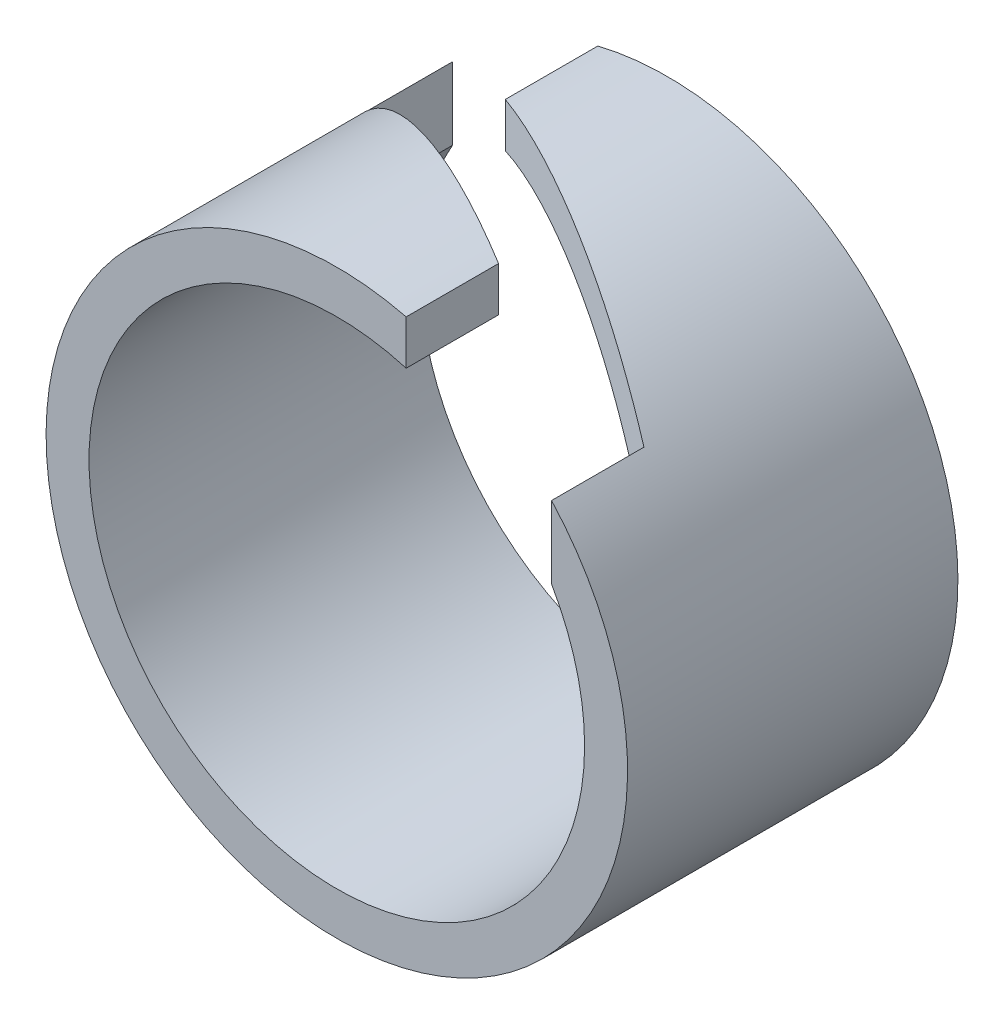
ISO-10303-21;
HEADER;
FILE_DESCRIPTION(('STEP AP214'),'2;1');
FILE_NAME('part.step','',(''),(''),'','','');
FILE_SCHEMA(('AUTOMOTIVE_DESIGN { 1 0 10303 214 1 1 1 1 }'));
ENDSEC;
DATA;
#1=APPLICATION_CONTEXT('core data for automotive mechanical design processes');
#2=APPLICATION_PROTOCOL_DEFINITION('international standard','automotive_design',2000,#1);
#3=PRODUCT_CONTEXT('',#1,'mechanical');
#4=PRODUCT('Part','Part','',(#3));
#5=PRODUCT_RELATED_PRODUCT_CATEGORY('part','',(#4));
#6=PRODUCT_DEFINITION_FORMATION('','',#4);
#7=PRODUCT_DEFINITION_CONTEXT('part definition',#1,'design');
#8=PRODUCT_DEFINITION('design','',#6,#7);
#9=PRODUCT_DEFINITION_SHAPE('','',#8);
#10=(LENGTH_UNIT() NAMED_UNIT(*) SI_UNIT(.MILLI.,.METRE.));
#11=(NAMED_UNIT(*) PLANE_ANGLE_UNIT() SI_UNIT($,.RADIAN.));
#12=(NAMED_UNIT(*) SI_UNIT($,.STERADIAN.) SOLID_ANGLE_UNIT());
#13=UNCERTAINTY_MEASURE_WITH_UNIT(LENGTH_MEASURE(1.E-05),#10,'distance_accuracy_value','');
#14=(GEOMETRIC_REPRESENTATION_CONTEXT(3) GLOBAL_UNCERTAINTY_ASSIGNED_CONTEXT((#13)) GLOBAL_UNIT_ASSIGNED_CONTEXT((#10,
#11,#12)) REPRESENTATION_CONTEXT('',''));
#15=CARTESIAN_POINT('',(0.,0.,0.));
#16=DIRECTION('',(0.,0.,1.));
#17=DIRECTION('',(1.,0.,0.));
#18=AXIS2_PLACEMENT_3D('',#15,#16,#17);
#19=CARTESIAN_POINT('',(0.,0.,5.));
#20=DIRECTION('',(0.,0.,1.));
#21=DIRECTION('',(1.,0.,0.));
#22=AXIS2_PLACEMENT_3D('',#19,#20,#21);
#23=PLANE('',#22);
#24=DIRECTION('',(0.,1.,0.));
#25=VECTOR('',#24,1.);
#26=CARTESIAN_POINT('',(3.25000000000104,-0.599999999999999,5.));
#27=LINE('',#26,#25);
#28=CARTESIAN_POINT('',(3.25000000000104,1.87082869338516,5.));
#29=VERTEX_POINT('',#28);
#30=CARTESIAN_POINT('',(3.25000000000104,2.96605798999164,5.));
#31=VERTEX_POINT('',#30);
#32=EDGE_CURVE('E170',#29,#31,#27,.T.);
#33=ORIENTED_EDGE('',*,*,#32,.F.);
#34=CARTESIAN_POINT('',(0.,0.,5.));
#35=DIRECTION('',(0.,0.,1.));
#36=DIRECTION('',(1.,0.,0.));
#37=AXIS2_PLACEMENT_3D('',#34,#35,#36);
#38=CIRCLE('',#37,3.75);
#39=CARTESIAN_POINT('',(1.05000000000104,3.5999999999997,5.));
#40=VERTEX_POINT('',#39);
#41=EDGE_CURVE('E135',#40,#29,#38,.T.);
#42=ORIENTED_EDGE('',*,*,#41,.F.);
#43=DIRECTION('',(0.,1.,0.));
#44=VECTOR('',#43,1.);
#45=CARTESIAN_POINT('',(1.05000000000104,-0.599999999999999,5.));
#46=LINE('',#45,#44);
#47=CARTESIAN_POINT('',(1.05000000000104,4.27287959109519,5.));
#48=VERTEX_POINT('',#47);
#49=EDGE_CURVE('E176',#40,#48,#46,.T.);
#50=ORIENTED_EDGE('',*,*,#49,.T.);
#51=CARTESIAN_POINT('',(0.,0.,5.));
#52=DIRECTION('',(0.,0.,1.));
#53=DIRECTION('',(1.,0.,0.));
#54=AXIS2_PLACEMENT_3D('',#51,#52,#53);
#55=CIRCLE('',#54,4.4);
#56=EDGE_CURVE('E145',#48,#31,#55,.T.);
#57=ORIENTED_EDGE('',*,*,#56,.T.);
#58=EDGE_LOOP('',(#33,#42,#50,#57));
#59=FACE_BOUND('',#58,.T.);
#60=ADVANCED_FACE('F45',(#59),#23,.T.);
#61=CARTESIAN_POINT('',(0.,0.,0.));
#62=DIRECTION('',(0.,0.,1.));
#63=DIRECTION('',(1.,0.,0.));
#64=AXIS2_PLACEMENT_3D('',#61,#62,#63);
#65=PLANE('',#64);
#66=CARTESIAN_POINT('',(0.,0.,0.));
#67=DIRECTION('',(0.,0.,1.));
#68=DIRECTION('',(1.,0.,0.));
#69=AXIS2_PLACEMENT_3D('',#66,#67,#68);
#70=CIRCLE('',#69,3.75);
#71=CARTESIAN_POINT('',(-3.25,1.87082869338697,0.));
#72=VERTEX_POINT('',#71);
#73=CARTESIAN_POINT('',(-1.05,3.6,0.));
#74=VERTEX_POINT('',#73);
#75=EDGE_CURVE('E130',#72,#74,#70,.T.);
#76=ORIENTED_EDGE('',*,*,#75,.T.);
#77=DIRECTION('',(0.,1.,0.));
#78=VECTOR('',#77,1.);
#79=CARTESIAN_POINT('',(-1.05,-0.599999999999999,0.));
#80=LINE('',#79,#78);
#81=CARTESIAN_POINT('',(-1.05,4.27287959109545,0.));
#82=VERTEX_POINT('',#81);
#83=EDGE_CURVE('E111',#74,#82,#80,.T.);
#84=ORIENTED_EDGE('',*,*,#83,.T.);
#85=CARTESIAN_POINT('',(0.,0.,0.));
#86=DIRECTION('',(0.,0.,1.));
#87=DIRECTION('',(1.,0.,0.));
#88=AXIS2_PLACEMENT_3D('',#85,#86,#87);
#89=CIRCLE('',#88,4.4);
#90=CARTESIAN_POINT('',(-3.25,2.96605798999278,0.));
#91=VERTEX_POINT('',#90);
#92=EDGE_CURVE('E140',#91,#82,#89,.T.);
#93=ORIENTED_EDGE('',*,*,#92,.F.);
#94=DIRECTION('',(0.,1.,0.));
#95=VECTOR('',#94,1.);
#96=CARTESIAN_POINT('',(-3.25,-0.599999999999999,0.));
#97=LINE('',#96,#95);
#98=EDGE_CURVE('E123',#72,#91,#97,.T.);
#99=ORIENTED_EDGE('',*,*,#98,.F.);
#100=EDGE_LOOP('',(#76,#84,#93,#99));
#101=FACE_BOUND('',#100,.T.);
#102=ADVANCED_FACE('F133',(#101),#65,.F.);
#103=CARTESIAN_POINT('',(0.,0.,5.));
#104=DIRECTION('',(0.,0.,-1.));
#105=DIRECTION('',(-1.,0.,0.));
#106=AXIS2_PLACEMENT_3D('',#103,#104,#105);
#107=CYLINDRICAL_SURFACE('',#106,4.4);
#108=ORIENTED_EDGE('',*,*,#92,.T.);
#109=DIRECTION('',(0.,0.,-1.));
#110=VECTOR('',#109,1.);
#111=CARTESIAN_POINT('',(-1.05,4.27287959109545,5.));
#112=LINE('',#111,#110);
#113=CARTESIAN_POINT('',(-1.05,4.27287959109545,1.4));
#114=VERTEX_POINT('',#113);
#115=EDGE_CURVE('E117',#82,#114,#112,.F.);
#116=ORIENTED_EDGE('',*,*,#115,.T.);
#117=CARTESIAN_POINT('',(0.,0.,1.93763907225766));
#118=DIRECTION('',(0.455764520981767,0.,-0.890100388391253));
#119=DIRECTION('',(-0.890100388391254,0.,-0.455764520981767));
#120=AXIS2_PLACEMENT_3D('',#117,#118,#119);
#121=ELLIPSE('',#120,4.94326264473658,4.4);
#122=CARTESIAN_POINT('',(3.25000000000104,2.96605798999164,3.60176001019857));
#123=VERTEX_POINT('',#122);
#124=EDGE_CURVE('E142',#114,#123,#121,.T.);
#125=ORIENTED_EDGE('',*,*,#124,.T.);
#126=DIRECTION('',(0.,0.,-1.));
#127=VECTOR('',#126,1.);
#128=CARTESIAN_POINT('',(3.25000000000104,2.96605798999164,5.));
#129=LINE('',#128,#127);
#130=EDGE_CURVE('E203',#123,#31,#129,.F.);
#131=ORIENTED_EDGE('',*,*,#130,.T.);
#132=ORIENTED_EDGE('',*,*,#56,.F.);
#133=DIRECTION('',(0.,0.,-1.));
#134=VECTOR('',#133,1.);
#135=CARTESIAN_POINT('',(1.05000000000104,4.27287959109519,5.));
#136=LINE('',#135,#134);
#137=CARTESIAN_POINT('',(1.05000000000104,4.27287959109519,3.60176001023201));
#138=VERTEX_POINT('',#137);
#139=EDGE_CURVE('E199',#48,#138,#136,.T.);
#140=ORIENTED_EDGE('',*,*,#139,.T.);
#141=CARTESIAN_POINT('',(0.,0.,3.06412093796565));
#142=DIRECTION('',(-0.455764520987252,0.,0.890100388388445));
#143=DIRECTION('',(-0.890100388388445,0.,-0.455764520987252));
#144=AXIS2_PLACEMENT_3D('',#141,#142,#143);
#145=ELLIPSE('',#144,4.94326264475217,4.4);
#146=CARTESIAN_POINT('',(-3.25,2.96605798999278,1.4));
#147=VERTEX_POINT('',#146);
#148=EDGE_CURVE('E196',#138,#147,#145,.T.);
#149=ORIENTED_EDGE('',*,*,#148,.T.);
#150=DIRECTION('',(0.,0.,-1.));
#151=VECTOR('',#150,1.);
#152=CARTESIAN_POINT('',(-3.25,2.96605798999278,5.));
#153=LINE('',#152,#151);
#154=EDGE_CURVE('E192',#147,#91,#153,.T.);
#155=ORIENTED_EDGE('',*,*,#154,.T.);
#156=EDGE_LOOP('',(#108,#116,#125,#131,#132,#140,#149,#155));
#157=FACE_BOUND('',#156,.T.);
#158=ADVANCED_FACE('F47',(#157),#107,.T.);
#159=CARTESIAN_POINT('',(0.,0.,5.));
#160=DIRECTION('',(0.,0.,-1.));
#161=DIRECTION('',(-1.,0.,0.));
#162=AXIS2_PLACEMENT_3D('',#159,#160,#161);
#163=CYLINDRICAL_SURFACE('',#162,3.75);
#164=DIRECTION('',(0.,0.,-1.));
#165=VECTOR('',#164,1.);
#166=CARTESIAN_POINT('',(-1.05,3.6,5.));
#167=LINE('',#166,#165);
#168=CARTESIAN_POINT('',(-1.05,3.6,1.4));
#169=VERTEX_POINT('',#168);
#170=EDGE_CURVE('E11',#74,#169,#167,.F.);
#171=ORIENTED_EDGE('',*,*,#170,.F.);
#172=ORIENTED_EDGE('',*,*,#75,.F.);
#173=DIRECTION('',(0.,0.,-1.));
#174=VECTOR('',#173,1.);
#175=CARTESIAN_POINT('',(-3.25,1.87082869338697,5.));
#176=LINE('',#175,#174);
#177=CARTESIAN_POINT('',(-3.25,1.87082869338697,1.4));
#178=VERTEX_POINT('',#177);
#179=EDGE_CURVE('E149',#178,#72,#176,.T.);
#180=ORIENTED_EDGE('',*,*,#179,.F.);
#181=CARTESIAN_POINT('',(0.,0.,3.06412093796565));
#182=DIRECTION('',(-0.455764520987252,0.,0.890100388388445));
#183=DIRECTION('',(-0.890100388388445,0.,-0.455764520987252));
#184=AXIS2_PLACEMENT_3D('',#181,#182,#183);
#185=ELLIPSE('',#184,4.21300793586833,3.75);
#186=CARTESIAN_POINT('',(1.05000000000104,3.5999999999997,3.60176001023201));
#187=VERTEX_POINT('',#186);
#188=EDGE_CURVE('E154',#187,#178,#185,.T.);
#189=ORIENTED_EDGE('',*,*,#188,.F.);
#190=DIRECTION('',(0.,0.,-1.));
#191=VECTOR('',#190,1.);
#192=CARTESIAN_POINT('',(1.05000000000104,3.5999999999997,5.));
#193=LINE('',#192,#191);
#194=EDGE_CURVE('E157',#40,#187,#193,.T.);
#195=ORIENTED_EDGE('',*,*,#194,.F.);
#196=ORIENTED_EDGE('',*,*,#41,.T.);
#197=DIRECTION('',(0.,0.,-1.));
#198=VECTOR('',#197,1.);
#199=CARTESIAN_POINT('',(3.25000000000104,1.87082869338516,5.));
#200=LINE('',#199,#198);
#201=CARTESIAN_POINT('',(3.25000000000104,1.87082869338516,3.60176001019857));
#202=VERTEX_POINT('',#201);
#203=EDGE_CURVE('E160',#202,#29,#200,.F.);
#204=ORIENTED_EDGE('',*,*,#203,.F.);
#205=CARTESIAN_POINT('',(0.,0.,1.93763907225766));
#206=DIRECTION('',(0.455764520981767,0.,-0.890100388391253));
#207=DIRECTION('',(-0.890100388391254,0.,-0.455764520981767));
#208=AXIS2_PLACEMENT_3D('',#205,#206,#207);
#209=ELLIPSE('',#208,4.21300793585504,3.75);
#210=EDGE_CURVE('E54',#169,#202,#209,.T.);
#211=ORIENTED_EDGE('',*,*,#210,.F.);
#212=EDGE_LOOP('',(#171,#172,#180,#189,#195,#196,#204,#211));
#213=FACE_BOUND('',#212,.T.);
#214=ADVANCED_FACE('F128',(#213),#163,.F.);
#215=CARTESIAN_POINT('',(-3.25,-0.599999999999999,1.4));
#216=DIRECTION('',(-1.,0.,0.));
#217=DIRECTION('',(0.,0.,1.));
#218=AXIS2_PLACEMENT_3D('',#215,#216,#217);
#219=PLANE('',#218);
#220=DIRECTION('',(0.,1.,0.));
#221=VECTOR('',#220,1.);
#222=CARTESIAN_POINT('',(-3.25,-0.599999999999999,1.4));
#223=LINE('',#222,#221);
#224=EDGE_CURVE('E69',#178,#147,#223,.T.);
#225=ORIENTED_EDGE('',*,*,#224,.F.);
#226=ORIENTED_EDGE('',*,*,#179,.T.);
#227=ORIENTED_EDGE('',*,*,#98,.T.);
#228=ORIENTED_EDGE('',*,*,#154,.F.);
#229=EDGE_LOOP('',(#225,#226,#227,#228));
#230=FACE_BOUND('',#229,.T.);
#231=ADVANCED_FACE('F209',(#230),#219,.F.);
#232=CARTESIAN_POINT('',(1.05000000000104,-0.599999999999999,3.60176001023201));
#233=DIRECTION('',(-0.455764520987252,0.,0.890100388388445));
#234=DIRECTION('',(0.890100388388445,0.,0.455764520987252));
#235=AXIS2_PLACEMENT_3D('',#232,#233,#234);
#236=PLANE('',#235);
#237=DIRECTION('',(0.,1.,0.));
#238=VECTOR('',#237,1.);
#239=CARTESIAN_POINT('',(1.05000000000104,-0.599999999999999,3.60176001023201));
#240=LINE('',#239,#238);
#241=EDGE_CURVE('E181',#187,#138,#240,.T.);
#242=ORIENTED_EDGE('',*,*,#241,.F.);
#243=ORIENTED_EDGE('',*,*,#188,.T.);
#244=ORIENTED_EDGE('',*,*,#224,.T.);
#245=ORIENTED_EDGE('',*,*,#148,.F.);
#246=EDGE_LOOP('',(#242,#243,#244,#245));
#247=FACE_BOUND('',#246,.T.);
#248=ADVANCED_FACE('F212',(#247),#236,.F.);
#249=CARTESIAN_POINT('',(1.05000000000104,-0.599999999999999,5.));
#250=DIRECTION('',(-1.,0.,0.));
#251=DIRECTION('',(0.,0.,1.));
#252=AXIS2_PLACEMENT_3D('',#249,#250,#251);
#253=PLANE('',#252);
#254=ORIENTED_EDGE('',*,*,#49,.F.);
#255=ORIENTED_EDGE('',*,*,#194,.T.);
#256=ORIENTED_EDGE('',*,*,#241,.T.);
#257=ORIENTED_EDGE('',*,*,#139,.F.);
#258=EDGE_LOOP('',(#254,#255,#256,#257));
#259=FACE_BOUND('',#258,.T.);
#260=ADVANCED_FACE('F215',(#259),#253,.F.);
#261=CARTESIAN_POINT('',(-1.05,-0.599999999999999,0.));
#262=DIRECTION('',(1.,0.,0.));
#263=DIRECTION('',(0.,0.,-1.));
#264=AXIS2_PLACEMENT_3D('',#261,#262,#263);
#265=PLANE('',#264);
#266=ORIENTED_EDGE('',*,*,#83,.F.);
#267=ORIENTED_EDGE('',*,*,#170,.T.);
#268=DIRECTION('',(0.,1.,0.));
#269=VECTOR('',#268,1.);
#270=CARTESIAN_POINT('',(-1.05,-0.599999999999999,1.4));
#271=LINE('',#270,#269);
#272=EDGE_CURVE('E165',#169,#114,#271,.T.);
#273=ORIENTED_EDGE('',*,*,#272,.T.);
#274=ORIENTED_EDGE('',*,*,#115,.F.);
#275=EDGE_LOOP('',(#266,#267,#273,#274));
#276=FACE_BOUND('',#275,.T.);
#277=ADVANCED_FACE('F113',(#276),#265,.F.);
#278=CARTESIAN_POINT('',(3.25000000000104,-0.599999999999999,3.60176001019857));
#279=DIRECTION('',(0.455764520981767,0.,-0.890100388391253));
#280=DIRECTION('',(-0.890100388391254,0.,-0.455764520981767));
#281=AXIS2_PLACEMENT_3D('',#278,#279,#280);
#282=PLANE('',#281);
#283=ORIENTED_EDGE('',*,*,#272,.F.);
#284=ORIENTED_EDGE('',*,*,#210,.T.);
#285=DIRECTION('',(0.,1.,0.));
#286=VECTOR('',#285,1.);
#287=CARTESIAN_POINT('',(3.25000000000104,-0.599999999999999,3.60176001019857));
#288=LINE('',#287,#286);
#289=EDGE_CURVE('E61',#202,#123,#288,.T.);
#290=ORIENTED_EDGE('',*,*,#289,.T.);
#291=ORIENTED_EDGE('',*,*,#124,.F.);
#292=EDGE_LOOP('',(#283,#284,#290,#291));
#293=FACE_BOUND('',#292,.T.);
#294=ADVANCED_FACE('F164',(#293),#282,.F.);
#295=CARTESIAN_POINT('',(3.25000000000104,-0.599999999999999,5.));
#296=DIRECTION('',(1.,0.,0.));
#297=DIRECTION('',(0.,0.,-1.));
#298=AXIS2_PLACEMENT_3D('',#295,#296,#297);
#299=PLANE('',#298);
#300=ORIENTED_EDGE('',*,*,#289,.F.);
#301=ORIENTED_EDGE('',*,*,#203,.T.);
#302=ORIENTED_EDGE('',*,*,#32,.T.);
#303=ORIENTED_EDGE('',*,*,#130,.F.);
#304=EDGE_LOOP('',(#300,#301,#302,#303));
#305=FACE_BOUND('',#304,.T.);
#306=ADVANCED_FACE('F169',(#305),#299,.F.);
#307=CLOSED_SHELL('',(#60,#102,#158,#214,#231,#248,#260,#277,#294,#306));
#308=MANIFOLD_SOLID_BREP('B2',#307);
#309=ADVANCED_BREP_SHAPE_REPRESENTATION('',(#18,#308),#14);
#310=SHAPE_DEFINITION_REPRESENTATION(#9,#309);
ENDSEC;
END-ISO-10303-21;
